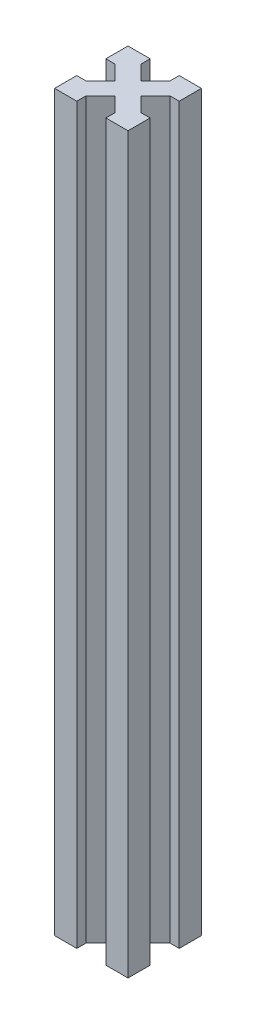
ISO-10303-21;
HEADER;
FILE_DESCRIPTION(('STEP AP214'),'2;1');
FILE_NAME('part.step','',(''),(''),'','','');
FILE_SCHEMA(('AUTOMOTIVE_DESIGN { 1 0 10303 214 1 1 1 1 }'));
ENDSEC;
DATA;
#1=APPLICATION_CONTEXT('core data for automotive mechanical design processes');
#2=APPLICATION_PROTOCOL_DEFINITION('international standard','automotive_design',2000,#1);
#3=PRODUCT_CONTEXT('',#1,'mechanical');
#4=PRODUCT('Part','Part','',(#3));
#5=PRODUCT_RELATED_PRODUCT_CATEGORY('part','',(#4));
#6=PRODUCT_DEFINITION_FORMATION('','',#4);
#7=PRODUCT_DEFINITION_CONTEXT('part definition',#1,'design');
#8=PRODUCT_DEFINITION('design','',#6,#7);
#9=PRODUCT_DEFINITION_SHAPE('','',#8);
#10=(LENGTH_UNIT() NAMED_UNIT(*) SI_UNIT(.MILLI.,.METRE.));
#11=(NAMED_UNIT(*) PLANE_ANGLE_UNIT() SI_UNIT($,.RADIAN.));
#12=(NAMED_UNIT(*) SI_UNIT($,.STERADIAN.) SOLID_ANGLE_UNIT());
#13=UNCERTAINTY_MEASURE_WITH_UNIT(LENGTH_MEASURE(1.E-05),#10,'distance_accuracy_value','');
#14=(GEOMETRIC_REPRESENTATION_CONTEXT(3) GLOBAL_UNCERTAINTY_ASSIGNED_CONTEXT((#13)) GLOBAL_UNIT_ASSIGNED_CONTEXT((#10,
#11,#12)) REPRESENTATION_CONTEXT('',''));
#15=CARTESIAN_POINT('',(0.,0.,0.));
#16=DIRECTION('',(0.,0.,1.));
#17=DIRECTION('',(1.,0.,0.));
#18=AXIS2_PLACEMENT_3D('',#15,#16,#17);
#19=CARTESIAN_POINT('',(-11.7677669529664,200.,-11.7677669529664));
#20=DIRECTION('',(0.707106781186548,0.,0.707106781186547));
#21=DIRECTION('',(0.707106781186547,0.,-0.707106781186548));
#22=AXIS2_PLACEMENT_3D('',#19,#20,#21);
#23=PLANE('',#22);
#24=DIRECTION('',(-0.707106781186547,0.,0.707106781186548));
#25=VECTOR('',#24,1.);
#26=CARTESIAN_POINT('',(-11.7677669529664,0.,-11.7677669529664));
#27=LINE('',#26,#25);
#28=CARTESIAN_POINT('',(-13.5355339059327,0.,-10.));
#29=VERTEX_POINT('',#28);
#30=CARTESIAN_POINT('',(-17.5,0.,-6.03553390593274));
#31=VERTEX_POINT('',#30);
#32=EDGE_CURVE('E226',#29,#31,#27,.T.);
#33=ORIENTED_EDGE('',*,*,#32,.T.);
#34=DIRECTION('',(0.,-1.,0.));
#35=VECTOR('',#34,1.);
#36=CARTESIAN_POINT('',(-17.5,200.,-6.03553390593274));
#37=LINE('',#36,#35);
#38=CARTESIAN_POINT('',(-17.5,200.,-6.03553390593274));
#39=VERTEX_POINT('',#38);
#40=EDGE_CURVE('E11',#39,#31,#37,.T.);
#41=ORIENTED_EDGE('',*,*,#40,.F.);
#42=DIRECTION('',(-0.707106781186547,0.,0.707106781186548));
#43=VECTOR('',#42,1.);
#44=CARTESIAN_POINT('',(-11.7677669529664,200.,-11.7677669529664));
#45=LINE('',#44,#43);
#46=CARTESIAN_POINT('',(-13.5355339059327,200.,-10.));
#47=VERTEX_POINT('',#46);
#48=EDGE_CURVE('E289',#47,#39,#45,.T.);
#49=ORIENTED_EDGE('',*,*,#48,.F.);
#50=DIRECTION('',(0.,-1.,0.));
#51=VECTOR('',#50,1.);
#52=CARTESIAN_POINT('',(-13.5355339059327,200.,-10.));
#53=LINE('',#52,#51);
#54=EDGE_CURVE('E222',#47,#29,#53,.T.);
#55=ORIENTED_EDGE('',*,*,#54,.T.);
#56=EDGE_LOOP('',(#33,#41,#49,#55));
#57=FACE_BOUND('',#56,.T.);
#58=ADVANCED_FACE('F36',(#57),#23,.F.);
#59=CARTESIAN_POINT('',(0.,200.,-6.03553390593273));
#60=DIRECTION('',(0.,0.,1.));
#61=DIRECTION('',(1.,0.,0.));
#62=AXIS2_PLACEMENT_3D('',#59,#60,#61);
#63=PLANE('',#62);
#64=DIRECTION('',(-1.,0.,0.));
#65=VECTOR('',#64,1.);
#66=CARTESIAN_POINT('',(0.,0.,-6.03553390593273));
#67=LINE('',#66,#65);
#68=CARTESIAN_POINT('',(-20.,0.,-6.03553390593273));
#69=VERTEX_POINT('',#68);
#70=EDGE_CURVE('E229',#31,#69,#67,.T.);
#71=ORIENTED_EDGE('',*,*,#70,.T.);
#72=DIRECTION('',(0.,-1.,0.));
#73=VECTOR('',#72,1.);
#74=CARTESIAN_POINT('',(-20.,200.,-6.03553390593273));
#75=LINE('',#74,#73);
#76=CARTESIAN_POINT('',(-20.,200.,-6.03553390593273));
#77=VERTEX_POINT('',#76);
#78=EDGE_CURVE('E44',#77,#69,#75,.T.);
#79=ORIENTED_EDGE('',*,*,#78,.F.);
#80=DIRECTION('',(-1.,0.,0.));
#81=VECTOR('',#80,1.);
#82=CARTESIAN_POINT('',(0.,200.,-6.03553390593273));
#83=LINE('',#82,#81);
#84=EDGE_CURVE('E139',#39,#77,#83,.T.);
#85=ORIENTED_EDGE('',*,*,#84,.F.);
#86=ORIENTED_EDGE('',*,*,#40,.T.);
#87=EDGE_LOOP('',(#71,#79,#85,#86));
#88=FACE_BOUND('',#87,.T.);
#89=ADVANCED_FACE('F338',(#88),#63,.F.);
#90=CARTESIAN_POINT('',(-20.,200.,0.));
#91=DIRECTION('',(-1.,0.,0.));
#92=DIRECTION('',(0.,0.,1.));
#93=AXIS2_PLACEMENT_3D('',#90,#91,#92);
#94=PLANE('',#93);
#95=DIRECTION('',(0.,0.,-1.));
#96=VECTOR('',#95,1.);
#97=CARTESIAN_POINT('',(-20.,0.,0.));
#98=LINE('',#97,#96);
#99=CARTESIAN_POINT('',(-20.,0.,0.));
#100=VERTEX_POINT('',#99);
#101=EDGE_CURVE('E232',#100,#69,#98,.T.);
#102=ORIENTED_EDGE('',*,*,#101,.F.);
#103=DIRECTION('',(0.,-1.,0.));
#104=VECTOR('',#103,1.);
#105=CARTESIAN_POINT('',(-20.,200.,0.));
#106=LINE('',#105,#104);
#107=CARTESIAN_POINT('',(-20.,200.,0.));
#108=VERTEX_POINT('',#107);
#109=EDGE_CURVE('E331',#108,#100,#106,.T.);
#110=ORIENTED_EDGE('',*,*,#109,.F.);
#111=DIRECTION('',(0.,0.,-1.));
#112=VECTOR('',#111,1.);
#113=CARTESIAN_POINT('',(-20.,200.,0.));
#114=LINE('',#113,#112);
#115=EDGE_CURVE('E337',#108,#77,#114,.T.);
#116=ORIENTED_EDGE('',*,*,#115,.T.);
#117=ORIENTED_EDGE('',*,*,#78,.T.);
#118=EDGE_LOOP('',(#102,#110,#116,#117));
#119=FACE_BOUND('',#118,.T.);
#120=ADVANCED_FACE('F335',(#119),#94,.T.);
#121=CARTESIAN_POINT('',(0.,200.,0.));
#122=DIRECTION('',(0.,0.,1.));
#123=DIRECTION('',(1.,0.,0.));
#124=AXIS2_PLACEMENT_3D('',#121,#122,#123);
#125=PLANE('',#124);
#126=DIRECTION('',(-1.,0.,0.));
#127=VECTOR('',#126,1.);
#128=CARTESIAN_POINT('',(0.,0.,0.));
#129=LINE('',#128,#127);
#130=CARTESIAN_POINT('',(-13.9644660940673,0.,0.));
#131=VERTEX_POINT('',#130);
#132=EDGE_CURVE('E235',#131,#100,#129,.T.);
#133=ORIENTED_EDGE('',*,*,#132,.F.);
#134=DIRECTION('',(0.,-1.,0.));
#135=VECTOR('',#134,1.);
#136=CARTESIAN_POINT('',(-13.9644660940673,200.,0.));
#137=LINE('',#136,#135);
#138=CARTESIAN_POINT('',(-13.9644660940673,200.,0.));
#139=VERTEX_POINT('',#138);
#140=EDGE_CURVE('E329',#139,#131,#137,.T.);
#141=ORIENTED_EDGE('',*,*,#140,.F.);
#142=DIRECTION('',(-1.,0.,0.));
#143=VECTOR('',#142,1.);
#144=CARTESIAN_POINT('',(0.,200.,0.));
#145=LINE('',#144,#143);
#146=EDGE_CURVE('E349',#139,#108,#145,.T.);
#147=ORIENTED_EDGE('',*,*,#146,.T.);
#148=ORIENTED_EDGE('',*,*,#109,.T.);
#149=EDGE_LOOP('',(#133,#141,#147,#148));
#150=FACE_BOUND('',#149,.T.);
#151=ADVANCED_FACE('F346',(#150),#125,.T.);
#152=CARTESIAN_POINT('',(-13.9644660940673,200.,0.));
#153=DIRECTION('',(1.,0.,0.));
#154=DIRECTION('',(0.,0.,-1.));
#155=AXIS2_PLACEMENT_3D('',#152,#153,#154);
#156=PLANE('',#155);
#157=DIRECTION('',(0.,0.,1.));
#158=VECTOR('',#157,1.);
#159=CARTESIAN_POINT('',(-13.9644660940673,0.,0.));
#160=LINE('',#159,#158);
#161=CARTESIAN_POINT('',(-13.9644660940673,0.,-2.5));
#162=VERTEX_POINT('',#161);
#163=EDGE_CURVE('E238',#162,#131,#160,.T.);
#164=ORIENTED_EDGE('',*,*,#163,.F.);
#165=DIRECTION('',(0.,-1.,0.));
#166=VECTOR('',#165,1.);
#167=CARTESIAN_POINT('',(-13.9644660940673,200.,-2.5));
#168=LINE('',#167,#166);
#169=CARTESIAN_POINT('',(-13.9644660940673,200.,-2.5));
#170=VERTEX_POINT('',#169);
#171=EDGE_CURVE('E327',#170,#162,#168,.T.);
#172=ORIENTED_EDGE('',*,*,#171,.F.);
#173=DIRECTION('',(0.,0.,1.));
#174=VECTOR('',#173,1.);
#175=CARTESIAN_POINT('',(-13.9644660940673,200.,0.));
#176=LINE('',#175,#174);
#177=EDGE_CURVE('E353',#170,#139,#176,.T.);
#178=ORIENTED_EDGE('',*,*,#177,.T.);
#179=ORIENTED_EDGE('',*,*,#140,.T.);
#180=EDGE_LOOP('',(#164,#172,#178,#179));
#181=FACE_BOUND('',#180,.T.);
#182=ADVANCED_FACE('F427',(#181),#156,.T.);
#183=CARTESIAN_POINT('',(-8.23223304703364,200.,-8.23223304703363));
#184=DIRECTION('',(0.707106781186548,0.,0.707106781186547));
#185=DIRECTION('',(0.707106781186547,0.,-0.707106781186548));
#186=AXIS2_PLACEMENT_3D('',#183,#184,#185);
#187=PLANE('',#186);
#188=DIRECTION('',(-0.707106781186547,0.,0.707106781186548));
#189=VECTOR('',#188,1.);
#190=CARTESIAN_POINT('',(-8.23223304703364,0.,-8.23223304703363));
#191=LINE('',#190,#189);
#192=CARTESIAN_POINT('',(-9.99999999999999,0.,-6.46446609406727));
#193=VERTEX_POINT('',#192);
#194=EDGE_CURVE('E241',#193,#162,#191,.T.);
#195=ORIENTED_EDGE('',*,*,#194,.F.);
#196=DIRECTION('',(0.,-1.,0.));
#197=VECTOR('',#196,1.);
#198=CARTESIAN_POINT('',(-9.99999999999999,200.,-6.46446609406727));
#199=LINE('',#198,#197);
#200=CARTESIAN_POINT('',(-9.99999999999999,200.,-6.46446609406727));
#201=VERTEX_POINT('',#200);
#202=EDGE_CURVE('E325',#201,#193,#199,.T.);
#203=ORIENTED_EDGE('',*,*,#202,.F.);
#204=DIRECTION('',(-0.707106781186547,0.,0.707106781186548));
#205=VECTOR('',#204,1.);
#206=CARTESIAN_POINT('',(-8.23223304703364,200.,-8.23223304703363));
#207=LINE('',#206,#205);
#208=EDGE_CURVE('E359',#201,#170,#207,.T.);
#209=ORIENTED_EDGE('',*,*,#208,.T.);
#210=ORIENTED_EDGE('',*,*,#171,.T.);
#211=EDGE_LOOP('',(#195,#203,#209,#210));
#212=FACE_BOUND('',#211,.T.);
#213=ADVANCED_FACE('F430',(#212),#187,.T.);
#214=CARTESIAN_POINT('',(-1.76776695296636,200.,1.76776695296636));
#215=DIRECTION('',(0.707106781186548,0.,-0.707106781186548));
#216=DIRECTION('',(-0.707106781186548,0.,-0.707106781186548));
#217=AXIS2_PLACEMENT_3D('',#214,#215,#216);
#218=PLANE('',#217);
#219=DIRECTION('',(0.707106781186548,0.,0.707106781186548));
#220=VECTOR('',#219,1.);
#221=CARTESIAN_POINT('',(-1.76776695296636,0.,1.76776695296636));
#222=LINE('',#221,#220);
#223=CARTESIAN_POINT('',(-6.03553390593273,0.,-2.5));
#224=VERTEX_POINT('',#223);
#225=EDGE_CURVE('E244',#193,#224,#222,.T.);
#226=ORIENTED_EDGE('',*,*,#225,.T.);
#227=DIRECTION('',(0.,-1.,0.));
#228=VECTOR('',#227,1.);
#229=CARTESIAN_POINT('',(-6.03553390593273,200.,-2.5));
#230=LINE('',#229,#228);
#231=CARTESIAN_POINT('',(-6.03553390593273,200.,-2.5));
#232=VERTEX_POINT('',#231);
#233=EDGE_CURVE('E322',#232,#224,#230,.T.);
#234=ORIENTED_EDGE('',*,*,#233,.F.);
#235=DIRECTION('',(0.707106781186548,0.,0.707106781186548));
#236=VECTOR('',#235,1.);
#237=CARTESIAN_POINT('',(-1.76776695296636,200.,1.76776695296636));
#238=LINE('',#237,#236);
#239=EDGE_CURVE('E362',#201,#232,#238,.T.);
#240=ORIENTED_EDGE('',*,*,#239,.F.);
#241=ORIENTED_EDGE('',*,*,#202,.T.);
#242=EDGE_LOOP('',(#226,#234,#240,#241));
#243=FACE_BOUND('',#242,.T.);
#244=ADVANCED_FACE('F434',(#243),#218,.F.);
#245=CARTESIAN_POINT('',(-6.03553390593273,200.,0.));
#246=DIRECTION('',(1.,0.,0.));
#247=DIRECTION('',(0.,0.,-1.));
#248=AXIS2_PLACEMENT_3D('',#245,#246,#247);
#249=PLANE('',#248);
#250=DIRECTION('',(0.,0.,1.));
#251=VECTOR('',#250,1.);
#252=CARTESIAN_POINT('',(-6.03553390593273,0.,0.));
#253=LINE('',#252,#251);
#254=CARTESIAN_POINT('',(-6.03553390593273,0.,0.));
#255=VERTEX_POINT('',#254);
#256=EDGE_CURVE('E246',#224,#255,#253,.T.);
#257=ORIENTED_EDGE('',*,*,#256,.T.);
#258=DIRECTION('',(0.,-1.,0.));
#259=VECTOR('',#258,1.);
#260=CARTESIAN_POINT('',(-6.03553390593273,200.,0.));
#261=LINE('',#260,#259);
#262=CARTESIAN_POINT('',(-6.03553390593273,200.,0.));
#263=VERTEX_POINT('',#262);
#264=EDGE_CURVE('E320',#263,#255,#261,.T.);
#265=ORIENTED_EDGE('',*,*,#264,.F.);
#266=DIRECTION('',(0.,0.,1.));
#267=VECTOR('',#266,1.);
#268=CARTESIAN_POINT('',(-6.03553390593273,200.,0.));
#269=LINE('',#268,#267);
#270=EDGE_CURVE('E364',#232,#263,#269,.T.);
#271=ORIENTED_EDGE('',*,*,#270,.F.);
#272=ORIENTED_EDGE('',*,*,#233,.T.);
#273=EDGE_LOOP('',(#257,#265,#271,#272));
#274=FACE_BOUND('',#273,.T.);
#275=ADVANCED_FACE('F438',(#274),#249,.F.);
#276=CARTESIAN_POINT('',(0.,200.,0.));
#277=DIRECTION('',(0.,0.,1.));
#278=DIRECTION('',(1.,0.,0.));
#279=AXIS2_PLACEMENT_3D('',#276,#277,#278);
#280=PLANE('',#279);
#281=DIRECTION('',(-1.,0.,0.));
#282=VECTOR('',#281,1.);
#283=CARTESIAN_POINT('',(0.,0.,0.));
#284=LINE('',#283,#282);
#285=CARTESIAN_POINT('',(0.,0.,0.));
#286=VERTEX_POINT('',#285);
#287=EDGE_CURVE('E249',#286,#255,#284,.T.);
#288=ORIENTED_EDGE('',*,*,#287,.F.);
#289=DIRECTION('',(0.,-1.,0.));
#290=VECTOR('',#289,1.);
#291=CARTESIAN_POINT('',(0.,200.,0.));
#292=LINE('',#291,#290);
#293=CARTESIAN_POINT('',(0.,200.,0.));
#294=VERTEX_POINT('',#293);
#295=EDGE_CURVE('E318',#294,#286,#292,.T.);
#296=ORIENTED_EDGE('',*,*,#295,.F.);
#297=DIRECTION('',(-1.,0.,0.));
#298=VECTOR('',#297,1.);
#299=CARTESIAN_POINT('',(0.,200.,0.));
#300=LINE('',#299,#298);
#301=EDGE_CURVE('E366',#294,#263,#300,.T.);
#302=ORIENTED_EDGE('',*,*,#301,.T.);
#303=ORIENTED_EDGE('',*,*,#264,.T.);
#304=EDGE_LOOP('',(#288,#296,#302,#303));
#305=FACE_BOUND('',#304,.T.);
#306=ADVANCED_FACE('F442',(#305),#280,.T.);
#307=CARTESIAN_POINT('',(0.,200.,0.));
#308=DIRECTION('',(-1.,0.,0.));
#309=DIRECTION('',(0.,0.,1.));
#310=AXIS2_PLACEMENT_3D('',#307,#308,#309);
#311=PLANE('',#310);
#312=DIRECTION('',(0.,0.,-1.));
#313=VECTOR('',#312,1.);
#314=CARTESIAN_POINT('',(0.,0.,0.));
#315=LINE('',#314,#313);
#316=CARTESIAN_POINT('',(0.,0.,-6.03553390593273));
#317=VERTEX_POINT('',#316);
#318=EDGE_CURVE('E252',#286,#317,#315,.T.);
#319=ORIENTED_EDGE('',*,*,#318,.T.);
#320=DIRECTION('',(0.,-1.,0.));
#321=VECTOR('',#320,1.);
#322=CARTESIAN_POINT('',(0.,200.,-6.03553390593273));
#323=LINE('',#322,#321);
#324=CARTESIAN_POINT('',(0.,200.,-6.03553390593273));
#325=VERTEX_POINT('',#324);
#326=EDGE_CURVE('E316',#325,#317,#323,.T.);
#327=ORIENTED_EDGE('',*,*,#326,.F.);
#328=DIRECTION('',(0.,0.,-1.));
#329=VECTOR('',#328,1.);
#330=CARTESIAN_POINT('',(0.,200.,0.));
#331=LINE('',#330,#329);
#332=EDGE_CURVE('E369',#294,#325,#331,.T.);
#333=ORIENTED_EDGE('',*,*,#332,.F.);
#334=ORIENTED_EDGE('',*,*,#295,.T.);
#335=EDGE_LOOP('',(#319,#327,#333,#334));
#336=FACE_BOUND('',#335,.T.);
#337=ADVANCED_FACE('F446',(#336),#311,.F.);
#338=CARTESIAN_POINT('',(0.,200.,-6.03553390593273));
#339=DIRECTION('',(0.,0.,-1.));
#340=DIRECTION('',(-1.,0.,0.));
#341=AXIS2_PLACEMENT_3D('',#338,#339,#340);
#342=PLANE('',#341);
#343=DIRECTION('',(1.,0.,0.));
#344=VECTOR('',#343,1.);
#345=CARTESIAN_POINT('',(0.,0.,-6.03553390593273));
#346=LINE('',#345,#344);
#347=CARTESIAN_POINT('',(-2.5,0.,-6.03553390593274));
#348=VERTEX_POINT('',#347);
#349=EDGE_CURVE('E255',#348,#317,#346,.T.);
#350=ORIENTED_EDGE('',*,*,#349,.F.);
#351=DIRECTION('',(0.,-1.,0.));
#352=VECTOR('',#351,1.);
#353=CARTESIAN_POINT('',(-2.5,200.,-6.03553390593274));
#354=LINE('',#353,#352);
#355=CARTESIAN_POINT('',(-2.5,200.,-6.03553390593274));
#356=VERTEX_POINT('',#355);
#357=EDGE_CURVE('E314',#356,#348,#354,.T.);
#358=ORIENTED_EDGE('',*,*,#357,.F.);
#359=DIRECTION('',(1.,0.,0.));
#360=VECTOR('',#359,1.);
#361=CARTESIAN_POINT('',(0.,200.,-6.03553390593273));
#362=LINE('',#361,#360);
#363=EDGE_CURVE('E371',#356,#325,#362,.T.);
#364=ORIENTED_EDGE('',*,*,#363,.T.);
#365=ORIENTED_EDGE('',*,*,#326,.T.);
#366=EDGE_LOOP('',(#350,#358,#364,#365));
#367=FACE_BOUND('',#366,.T.);
#368=ADVANCED_FACE('F450',(#367),#342,.T.);
#369=CARTESIAN_POINT('',(1.76776695296637,200.,-1.76776695296637));
#370=DIRECTION('',(0.707106781186548,0.,-0.707106781186548));
#371=DIRECTION('',(-0.707106781186548,0.,-0.707106781186548));
#372=AXIS2_PLACEMENT_3D('',#369,#370,#371);
#373=PLANE('',#372);
#374=DIRECTION('',(0.707106781186548,0.,0.707106781186548));
#375=VECTOR('',#374,1.);
#376=CARTESIAN_POINT('',(1.76776695296637,0.,-1.76776695296637));
#377=LINE('',#376,#375);
#378=CARTESIAN_POINT('',(-6.46446609406727,0.,-10.));
#379=VERTEX_POINT('',#378);
#380=EDGE_CURVE('E258',#379,#348,#377,.T.);
#381=ORIENTED_EDGE('',*,*,#380,.F.);
#382=DIRECTION('',(0.,-1.,0.));
#383=VECTOR('',#382,1.);
#384=CARTESIAN_POINT('',(-6.46446609406727,200.,-10.));
#385=LINE('',#384,#383);
#386=CARTESIAN_POINT('',(-6.46446609406727,200.,-10.));
#387=VERTEX_POINT('',#386);
#388=EDGE_CURVE('E312',#387,#379,#385,.T.);
#389=ORIENTED_EDGE('',*,*,#388,.F.);
#390=DIRECTION('',(0.707106781186548,0.,0.707106781186548));
#391=VECTOR('',#390,1.);
#392=CARTESIAN_POINT('',(1.76776695296637,200.,-1.76776695296637));
#393=LINE('',#392,#391);
#394=EDGE_CURVE('E374',#387,#356,#393,.T.);
#395=ORIENTED_EDGE('',*,*,#394,.T.);
#396=ORIENTED_EDGE('',*,*,#357,.T.);
#397=EDGE_LOOP('',(#381,#389,#395,#396));
#398=FACE_BOUND('',#397,.T.);
#399=ADVANCED_FACE('F454',(#398),#373,.T.);
#400=CARTESIAN_POINT('',(-8.23223304703364,200.,-8.23223304703363));
#401=DIRECTION('',(0.707106781186548,0.,0.707106781186547));
#402=DIRECTION('',(0.707106781186547,0.,-0.707106781186548));
#403=AXIS2_PLACEMENT_3D('',#400,#401,#402);
#404=PLANE('',#403);
#405=DIRECTION('',(-0.707106781186547,0.,0.707106781186548));
#406=VECTOR('',#405,1.);
#407=CARTESIAN_POINT('',(-8.23223304703364,0.,-8.23223304703363));
#408=LINE('',#407,#406);
#409=CARTESIAN_POINT('',(-2.50000000000001,0.,-13.9644660940673));
#410=VERTEX_POINT('',#409);
#411=EDGE_CURVE('E261',#410,#379,#408,.T.);
#412=ORIENTED_EDGE('',*,*,#411,.F.);
#413=DIRECTION('',(0.,-1.,0.));
#414=VECTOR('',#413,1.);
#415=CARTESIAN_POINT('',(-2.50000000000001,200.,-13.9644660940673));
#416=LINE('',#415,#414);
#417=CARTESIAN_POINT('',(-2.50000000000001,200.,-13.9644660940673));
#418=VERTEX_POINT('',#417);
#419=EDGE_CURVE('E310',#418,#410,#416,.T.);
#420=ORIENTED_EDGE('',*,*,#419,.F.);
#421=DIRECTION('',(-0.707106781186547,0.,0.707106781186548));
#422=VECTOR('',#421,1.);
#423=CARTESIAN_POINT('',(-8.23223304703364,200.,-8.23223304703363));
#424=LINE('',#423,#422);
#425=EDGE_CURVE('E377',#418,#387,#424,.T.);
#426=ORIENTED_EDGE('',*,*,#425,.T.);
#427=ORIENTED_EDGE('',*,*,#388,.T.);
#428=EDGE_LOOP('',(#412,#420,#426,#427));
#429=FACE_BOUND('',#428,.T.);
#430=ADVANCED_FACE('F458',(#429),#404,.T.);
#431=CARTESIAN_POINT('',(0.,200.,-13.9644660940673));
#432=DIRECTION('',(0.,0.,-1.));
#433=DIRECTION('',(-1.,0.,0.));
#434=AXIS2_PLACEMENT_3D('',#431,#432,#433);
#435=PLANE('',#434);
#436=DIRECTION('',(1.,0.,0.));
#437=VECTOR('',#436,1.);
#438=CARTESIAN_POINT('',(0.,0.,-13.9644660940673));
#439=LINE('',#438,#437);
#440=CARTESIAN_POINT('',(0.,0.,-13.9644660940673));
#441=VERTEX_POINT('',#440);
#442=EDGE_CURVE('E264',#410,#441,#439,.T.);
#443=ORIENTED_EDGE('',*,*,#442,.T.);
#444=DIRECTION('',(0.,-1.,0.));
#445=VECTOR('',#444,1.);
#446=CARTESIAN_POINT('',(0.,200.,-13.9644660940673));
#447=LINE('',#446,#445);
#448=CARTESIAN_POINT('',(0.,200.,-13.9644660940673));
#449=VERTEX_POINT('',#448);
#450=EDGE_CURVE('E307',#449,#441,#447,.T.);
#451=ORIENTED_EDGE('',*,*,#450,.F.);
#452=DIRECTION('',(1.,0.,0.));
#453=VECTOR('',#452,1.);
#454=CARTESIAN_POINT('',(0.,200.,-13.9644660940673));
#455=LINE('',#454,#453);
#456=EDGE_CURVE('E380',#418,#449,#455,.T.);
#457=ORIENTED_EDGE('',*,*,#456,.F.);
#458=ORIENTED_EDGE('',*,*,#419,.T.);
#459=EDGE_LOOP('',(#443,#451,#457,#458));
#460=FACE_BOUND('',#459,.T.);
#461=ADVANCED_FACE('F462',(#460),#435,.F.);
#462=CARTESIAN_POINT('',(0.,200.,0.));
#463=DIRECTION('',(-1.,0.,0.));
#464=DIRECTION('',(0.,0.,1.));
#465=AXIS2_PLACEMENT_3D('',#462,#463,#464);
#466=PLANE('',#465);
#467=DIRECTION('',(0.,0.,-1.));
#468=VECTOR('',#467,1.);
#469=CARTESIAN_POINT('',(0.,0.,0.));
#470=LINE('',#469,#468);
#471=CARTESIAN_POINT('',(0.,0.,-20.));
#472=VERTEX_POINT('',#471);
#473=EDGE_CURVE('E266',#441,#472,#470,.T.);
#474=ORIENTED_EDGE('',*,*,#473,.T.);
#475=DIRECTION('',(0.,-1.,0.));
#476=VECTOR('',#475,1.);
#477=CARTESIAN_POINT('',(0.,200.,-20.));
#478=LINE('',#477,#476);
#479=CARTESIAN_POINT('',(0.,200.,-20.));
#480=VERTEX_POINT('',#479);
#481=EDGE_CURVE('E304',#480,#472,#478,.T.);
#482=ORIENTED_EDGE('',*,*,#481,.F.);
#483=DIRECTION('',(0.,0.,-1.));
#484=VECTOR('',#483,1.);
#485=CARTESIAN_POINT('',(0.,200.,0.));
#486=LINE('',#485,#484);
#487=EDGE_CURVE('E382',#449,#480,#486,.T.);
#488=ORIENTED_EDGE('',*,*,#487,.F.);
#489=ORIENTED_EDGE('',*,*,#450,.T.);
#490=EDGE_LOOP('',(#474,#482,#488,#489));
#491=FACE_BOUND('',#490,.T.);
#492=ADVANCED_FACE('F466',(#491),#466,.F.);
#493=CARTESIAN_POINT('',(0.,200.,-20.));
#494=DIRECTION('',(0.,0.,1.));
#495=DIRECTION('',(1.,0.,0.));
#496=AXIS2_PLACEMENT_3D('',#493,#494,#495);
#497=PLANE('',#496);
#498=DIRECTION('',(-1.,0.,0.));
#499=VECTOR('',#498,1.);
#500=CARTESIAN_POINT('',(0.,0.,-20.));
#501=LINE('',#500,#499);
#502=CARTESIAN_POINT('',(-6.03553390593273,0.,-20.));
#503=VERTEX_POINT('',#502);
#504=EDGE_CURVE('E268',#472,#503,#501,.T.);
#505=ORIENTED_EDGE('',*,*,#504,.T.);
#506=DIRECTION('',(0.,-1.,0.));
#507=VECTOR('',#506,1.);
#508=CARTESIAN_POINT('',(-6.03553390593273,200.,-20.));
#509=LINE('',#508,#507);
#510=CARTESIAN_POINT('',(-6.03553390593273,200.,-20.));
#511=VERTEX_POINT('',#510);
#512=EDGE_CURVE('E302',#511,#503,#509,.T.);
#513=ORIENTED_EDGE('',*,*,#512,.F.);
#514=DIRECTION('',(-1.,0.,0.));
#515=VECTOR('',#514,1.);
#516=CARTESIAN_POINT('',(0.,200.,-20.));
#517=LINE('',#516,#515);
#518=EDGE_CURVE('E384',#480,#511,#517,.T.);
#519=ORIENTED_EDGE('',*,*,#518,.F.);
#520=ORIENTED_EDGE('',*,*,#481,.T.);
#521=EDGE_LOOP('',(#505,#513,#519,#520));
#522=FACE_BOUND('',#521,.T.);
#523=ADVANCED_FACE('F470',(#522),#497,.F.);
#524=CARTESIAN_POINT('',(-6.03553390593271,200.,0.));
#525=DIRECTION('',(-1.,0.,0.));
#526=DIRECTION('',(0.,0.,1.));
#527=AXIS2_PLACEMENT_3D('',#524,#525,#526);
#528=PLANE('',#527);
#529=DIRECTION('',(0.,0.,-1.));
#530=VECTOR('',#529,1.);
#531=CARTESIAN_POINT('',(-6.03553390593271,0.,0.));
#532=LINE('',#531,#530);
#533=CARTESIAN_POINT('',(-6.03553390593274,0.,-17.5));
#534=VERTEX_POINT('',#533);
#535=EDGE_CURVE('E271',#534,#503,#532,.T.);
#536=ORIENTED_EDGE('',*,*,#535,.F.);
#537=DIRECTION('',(0.,-1.,0.));
#538=VECTOR('',#537,1.);
#539=CARTESIAN_POINT('',(-6.03553390593274,200.,-17.5));
#540=LINE('',#539,#538);
#541=CARTESIAN_POINT('',(-6.03553390593274,200.,-17.5));
#542=VERTEX_POINT('',#541);
#543=EDGE_CURVE('E300',#542,#534,#540,.T.);
#544=ORIENTED_EDGE('',*,*,#543,.F.);
#545=DIRECTION('',(0.,0.,-1.));
#546=VECTOR('',#545,1.);
#547=CARTESIAN_POINT('',(-6.03553390593271,200.,0.));
#548=LINE('',#547,#546);
#549=EDGE_CURVE('E386',#542,#511,#548,.T.);
#550=ORIENTED_EDGE('',*,*,#549,.T.);
#551=ORIENTED_EDGE('',*,*,#512,.T.);
#552=EDGE_LOOP('',(#536,#544,#550,#551));
#553=FACE_BOUND('',#552,.T.);
#554=ADVANCED_FACE('F474',(#553),#528,.T.);
#555=CARTESIAN_POINT('',(-11.7677669529664,200.,-11.7677669529664));
#556=DIRECTION('',(0.707106781186548,0.,0.707106781186547));
#557=DIRECTION('',(0.707106781186547,0.,-0.707106781186548));
#558=AXIS2_PLACEMENT_3D('',#555,#556,#557);
#559=PLANE('',#558);
#560=DIRECTION('',(-0.707106781186547,0.,0.707106781186548));
#561=VECTOR('',#560,1.);
#562=CARTESIAN_POINT('',(-11.7677669529664,0.,-11.7677669529664));
#563=LINE('',#562,#561);
#564=CARTESIAN_POINT('',(-10.,0.,-13.5355339059327));
#565=VERTEX_POINT('',#564);
#566=EDGE_CURVE('E274',#534,#565,#563,.T.);
#567=ORIENTED_EDGE('',*,*,#566,.T.);
#568=DIRECTION('',(0.,-1.,0.));
#569=VECTOR('',#568,1.);
#570=CARTESIAN_POINT('',(-10.,200.,-13.5355339059327));
#571=LINE('',#570,#569);
#572=CARTESIAN_POINT('',(-10.,200.,-13.5355339059327));
#573=VERTEX_POINT('',#572);
#574=EDGE_CURVE('E298',#573,#565,#571,.T.);
#575=ORIENTED_EDGE('',*,*,#574,.F.);
#576=DIRECTION('',(-0.707106781186547,0.,0.707106781186548));
#577=VECTOR('',#576,1.);
#578=CARTESIAN_POINT('',(-11.7677669529664,200.,-11.7677669529664));
#579=LINE('',#578,#577);
#580=EDGE_CURVE('E389',#542,#573,#579,.T.);
#581=ORIENTED_EDGE('',*,*,#580,.F.);
#582=ORIENTED_EDGE('',*,*,#543,.T.);
#583=EDGE_LOOP('',(#567,#575,#581,#582));
#584=FACE_BOUND('',#583,.T.);
#585=ADVANCED_FACE('F478',(#584),#559,.F.);
#586=CARTESIAN_POINT('',(1.76776695296637,200.,-1.76776695296637));
#587=DIRECTION('',(0.707106781186548,0.,-0.707106781186548));
#588=DIRECTION('',(-0.707106781186548,0.,-0.707106781186548));
#589=AXIS2_PLACEMENT_3D('',#586,#587,#588);
#590=PLANE('',#589);
#591=DIRECTION('',(0.707106781186548,0.,0.707106781186548));
#592=VECTOR('',#591,1.);
#593=CARTESIAN_POINT('',(1.76776695296637,0.,-1.76776695296637));
#594=LINE('',#593,#592);
#595=CARTESIAN_POINT('',(-13.9644660940673,0.,-17.5));
#596=VERTEX_POINT('',#595);
#597=EDGE_CURVE('E277',#596,#565,#594,.T.);
#598=ORIENTED_EDGE('',*,*,#597,.F.);
#599=DIRECTION('',(0.,-1.,0.));
#600=VECTOR('',#599,1.);
#601=CARTESIAN_POINT('',(-13.9644660940673,200.,-17.5));
#602=LINE('',#601,#600);
#603=CARTESIAN_POINT('',(-13.9644660940673,200.,-17.5));
#604=VERTEX_POINT('',#603);
#605=EDGE_CURVE('E296',#604,#596,#602,.T.);
#606=ORIENTED_EDGE('',*,*,#605,.F.);
#607=DIRECTION('',(0.707106781186548,0.,0.707106781186548));
#608=VECTOR('',#607,1.);
#609=CARTESIAN_POINT('',(1.76776695296637,200.,-1.76776695296637));
#610=LINE('',#609,#608);
#611=EDGE_CURVE('E391',#604,#573,#610,.T.);
#612=ORIENTED_EDGE('',*,*,#611,.T.);
#613=ORIENTED_EDGE('',*,*,#574,.T.);
#614=EDGE_LOOP('',(#598,#606,#612,#613));
#615=FACE_BOUND('',#614,.T.);
#616=ADVANCED_FACE('F482',(#615),#590,.T.);
#617=CARTESIAN_POINT('',(-13.9644660940673,200.,0.));
#618=DIRECTION('',(-1.,0.,0.));
#619=DIRECTION('',(0.,0.,1.));
#620=AXIS2_PLACEMENT_3D('',#617,#618,#619);
#621=PLANE('',#620);
#622=DIRECTION('',(0.,0.,-1.));
#623=VECTOR('',#622,1.);
#624=CARTESIAN_POINT('',(-13.9644660940673,0.,0.));
#625=LINE('',#624,#623);
#626=CARTESIAN_POINT('',(-13.9644660940673,0.,-20.));
#627=VERTEX_POINT('',#626);
#628=EDGE_CURVE('E280',#596,#627,#625,.T.);
#629=ORIENTED_EDGE('',*,*,#628,.T.);
#630=DIRECTION('',(0.,-1.,0.));
#631=VECTOR('',#630,1.);
#632=CARTESIAN_POINT('',(-13.9644660940673,200.,-20.));
#633=LINE('',#632,#631);
#634=CARTESIAN_POINT('',(-13.9644660940673,200.,-20.));
#635=VERTEX_POINT('',#634);
#636=EDGE_CURVE('E293',#635,#627,#633,.T.);
#637=ORIENTED_EDGE('',*,*,#636,.F.);
#638=DIRECTION('',(0.,0.,-1.));
#639=VECTOR('',#638,1.);
#640=CARTESIAN_POINT('',(-13.9644660940673,200.,0.));
#641=LINE('',#640,#639);
#642=EDGE_CURVE('E394',#604,#635,#641,.T.);
#643=ORIENTED_EDGE('',*,*,#642,.F.);
#644=ORIENTED_EDGE('',*,*,#605,.T.);
#645=EDGE_LOOP('',(#629,#637,#643,#644));
#646=FACE_BOUND('',#645,.T.);
#647=ADVANCED_FACE('F399',(#646),#621,.F.);
#648=CARTESIAN_POINT('',(0.,200.,-20.));
#649=DIRECTION('',(0.,0.,1.));
#650=DIRECTION('',(1.,0.,0.));
#651=AXIS2_PLACEMENT_3D('',#648,#649,#650);
#652=PLANE('',#651);
#653=DIRECTION('',(-1.,0.,0.));
#654=VECTOR('',#653,1.);
#655=CARTESIAN_POINT('',(0.,0.,-20.));
#656=LINE('',#655,#654);
#657=CARTESIAN_POINT('',(-20.,0.,-20.));
#658=VERTEX_POINT('',#657);
#659=EDGE_CURVE('E282',#627,#658,#656,.T.);
#660=ORIENTED_EDGE('',*,*,#659,.T.);
#661=DIRECTION('',(0.,-1.,0.));
#662=VECTOR('',#661,1.);
#663=CARTESIAN_POINT('',(-20.,200.,-20.));
#664=LINE('',#663,#662);
#665=CARTESIAN_POINT('',(-20.,200.,-20.));
#666=VERTEX_POINT('',#665);
#667=EDGE_CURVE('E212',#666,#658,#664,.T.);
#668=ORIENTED_EDGE('',*,*,#667,.F.);
#669=DIRECTION('',(-1.,0.,0.));
#670=VECTOR('',#669,1.);
#671=CARTESIAN_POINT('',(0.,200.,-20.));
#672=LINE('',#671,#670);
#673=EDGE_CURVE('E217',#635,#666,#672,.T.);
#674=ORIENTED_EDGE('',*,*,#673,.F.);
#675=ORIENTED_EDGE('',*,*,#636,.T.);
#676=EDGE_LOOP('',(#660,#668,#674,#675));
#677=FACE_BOUND('',#676,.T.);
#678=ADVANCED_FACE('F403',(#677),#652,.F.);
#679=CARTESIAN_POINT('',(-20.,200.,0.));
#680=DIRECTION('',(-1.,0.,0.));
#681=DIRECTION('',(0.,0.,1.));
#682=AXIS2_PLACEMENT_3D('',#679,#680,#681);
#683=PLANE('',#682);
#684=DIRECTION('',(0.,0.,-1.));
#685=VECTOR('',#684,1.);
#686=CARTESIAN_POINT('',(-20.,0.,0.));
#687=LINE('',#686,#685);
#688=CARTESIAN_POINT('',(-20.,0.,-13.9644660940673));
#689=VERTEX_POINT('',#688);
#690=EDGE_CURVE('E207',#689,#658,#687,.T.);
#691=ORIENTED_EDGE('',*,*,#690,.F.);
#692=DIRECTION('',(0.,-1.,0.));
#693=VECTOR('',#692,1.);
#694=CARTESIAN_POINT('',(-20.,200.,-13.9644660940673));
#695=LINE('',#694,#693);
#696=CARTESIAN_POINT('',(-20.,200.,-13.9644660940673));
#697=VERTEX_POINT('',#696);
#698=EDGE_CURVE('E202',#697,#689,#695,.T.);
#699=ORIENTED_EDGE('',*,*,#698,.F.);
#700=DIRECTION('',(0.,0.,-1.));
#701=VECTOR('',#700,1.);
#702=CARTESIAN_POINT('',(-20.,200.,0.));
#703=LINE('',#702,#701);
#704=EDGE_CURVE('E205',#697,#666,#703,.T.);
#705=ORIENTED_EDGE('',*,*,#704,.T.);
#706=ORIENTED_EDGE('',*,*,#667,.T.);
#707=EDGE_LOOP('',(#691,#699,#705,#706));
#708=FACE_BOUND('',#707,.T.);
#709=ADVANCED_FACE('F204',(#708),#683,.T.);
#710=CARTESIAN_POINT('',(0.,200.,-13.9644660940673));
#711=DIRECTION('',(0.,0.,1.));
#712=DIRECTION('',(1.,0.,0.));
#713=AXIS2_PLACEMENT_3D('',#710,#711,#712);
#714=PLANE('',#713);
#715=DIRECTION('',(-1.,0.,0.));
#716=VECTOR('',#715,1.);
#717=CARTESIAN_POINT('',(0.,0.,-13.9644660940673));
#718=LINE('',#717,#716);
#719=CARTESIAN_POINT('',(-17.5,0.,-13.9644660940673));
#720=VERTEX_POINT('',#719);
#721=EDGE_CURVE('E286',#720,#689,#718,.T.);
#722=ORIENTED_EDGE('',*,*,#721,.F.);
#723=DIRECTION('',(0.,-1.,0.));
#724=VECTOR('',#723,1.);
#725=CARTESIAN_POINT('',(-17.5,200.,-13.9644660940673));
#726=LINE('',#725,#724);
#727=CARTESIAN_POINT('',(-17.5,200.,-13.9644660940673));
#728=VERTEX_POINT('',#727);
#729=EDGE_CURVE('E128',#728,#720,#726,.T.);
#730=ORIENTED_EDGE('',*,*,#729,.F.);
#731=DIRECTION('',(-1.,0.,0.));
#732=VECTOR('',#731,1.);
#733=CARTESIAN_POINT('',(0.,200.,-13.9644660940673));
#734=LINE('',#733,#732);
#735=EDGE_CURVE('E215',#728,#697,#734,.T.);
#736=ORIENTED_EDGE('',*,*,#735,.T.);
#737=ORIENTED_EDGE('',*,*,#698,.T.);
#738=EDGE_LOOP('',(#722,#730,#736,#737));
#739=FACE_BOUND('',#738,.T.);
#740=ADVANCED_FACE('F220',(#739),#714,.T.);
#741=CARTESIAN_POINT('',(-1.76776695296636,200.,1.76776695296636));
#742=DIRECTION('',(0.707106781186548,0.,-0.707106781186548));
#743=DIRECTION('',(-0.707106781186548,0.,-0.707106781186548));
#744=AXIS2_PLACEMENT_3D('',#741,#742,#743);
#745=PLANE('',#744);
#746=DIRECTION('',(0.707106781186548,0.,0.707106781186548));
#747=VECTOR('',#746,1.);
#748=CARTESIAN_POINT('',(-1.76776695296636,0.,1.76776695296636));
#749=LINE('',#748,#747);
#750=EDGE_CURVE('E131',#720,#29,#749,.T.);
#751=ORIENTED_EDGE('',*,*,#750,.T.);
#752=ORIENTED_EDGE('',*,*,#54,.F.);
#753=DIRECTION('',(0.707106781186548,0.,0.707106781186548));
#754=VECTOR('',#753,1.);
#755=CARTESIAN_POINT('',(-1.76776695296636,200.,1.76776695296636));
#756=LINE('',#755,#754);
#757=EDGE_CURVE('E52',#728,#47,#756,.T.);
#758=ORIENTED_EDGE('',*,*,#757,.F.);
#759=ORIENTED_EDGE('',*,*,#729,.T.);
#760=EDGE_LOOP('',(#751,#752,#758,#759));
#761=FACE_BOUND('',#760,.T.);
#762=ADVANCED_FACE('F406',(#761),#745,.F.);
#763=CARTESIAN_POINT('',(0.,200.,0.));
#764=DIRECTION('',(0.,1.,0.));
#765=DIRECTION('',(0.,0.,1.));
#766=AXIS2_PLACEMENT_3D('',#763,#764,#765);
#767=PLANE('',#766);
#768=ORIENTED_EDGE('',*,*,#48,.T.);
#769=ORIENTED_EDGE('',*,*,#84,.T.);
#770=ORIENTED_EDGE('',*,*,#115,.F.);
#771=ORIENTED_EDGE('',*,*,#146,.F.);
#772=ORIENTED_EDGE('',*,*,#177,.F.);
#773=ORIENTED_EDGE('',*,*,#208,.F.);
#774=ORIENTED_EDGE('',*,*,#239,.T.);
#775=ORIENTED_EDGE('',*,*,#270,.T.);
#776=ORIENTED_EDGE('',*,*,#301,.F.);
#777=ORIENTED_EDGE('',*,*,#332,.T.);
#778=ORIENTED_EDGE('',*,*,#363,.F.);
#779=ORIENTED_EDGE('',*,*,#394,.F.);
#780=ORIENTED_EDGE('',*,*,#425,.F.);
#781=ORIENTED_EDGE('',*,*,#456,.T.);
#782=ORIENTED_EDGE('',*,*,#487,.T.);
#783=ORIENTED_EDGE('',*,*,#518,.T.);
#784=ORIENTED_EDGE('',*,*,#549,.F.);
#785=ORIENTED_EDGE('',*,*,#580,.T.);
#786=ORIENTED_EDGE('',*,*,#611,.F.);
#787=ORIENTED_EDGE('',*,*,#642,.T.);
#788=ORIENTED_EDGE('',*,*,#673,.T.);
#789=ORIENTED_EDGE('',*,*,#704,.F.);
#790=ORIENTED_EDGE('',*,*,#735,.F.);
#791=ORIENTED_EDGE('',*,*,#757,.T.);
#792=EDGE_LOOP('',(#768,#769,#770,#771,#772,#773,#774,#775,#776,#777,#778,#779,#780,#781,#782,
#783,#784,#785,#786,#787,#788,#789,#790,#791));
#793=FACE_BOUND('',#792,.T.);
#794=ADVANCED_FACE('F214',(#793),#767,.T.);
#795=CARTESIAN_POINT('',(0.,0.,0.));
#796=DIRECTION('',(0.,1.,0.));
#797=DIRECTION('',(0.,0.,1.));
#798=AXIS2_PLACEMENT_3D('',#795,#796,#797);
#799=PLANE('',#798);
#800=ORIENTED_EDGE('',*,*,#32,.F.);
#801=ORIENTED_EDGE('',*,*,#750,.F.);
#802=ORIENTED_EDGE('',*,*,#721,.T.);
#803=ORIENTED_EDGE('',*,*,#690,.T.);
#804=ORIENTED_EDGE('',*,*,#659,.F.);
#805=ORIENTED_EDGE('',*,*,#628,.F.);
#806=ORIENTED_EDGE('',*,*,#597,.T.);
#807=ORIENTED_EDGE('',*,*,#566,.F.);
#808=ORIENTED_EDGE('',*,*,#535,.T.);
#809=ORIENTED_EDGE('',*,*,#504,.F.);
#810=ORIENTED_EDGE('',*,*,#473,.F.);
#811=ORIENTED_EDGE('',*,*,#442,.F.);
#812=ORIENTED_EDGE('',*,*,#411,.T.);
#813=ORIENTED_EDGE('',*,*,#380,.T.);
#814=ORIENTED_EDGE('',*,*,#349,.T.);
#815=ORIENTED_EDGE('',*,*,#318,.F.);
#816=ORIENTED_EDGE('',*,*,#287,.T.);
#817=ORIENTED_EDGE('',*,*,#256,.F.);
#818=ORIENTED_EDGE('',*,*,#225,.F.);
#819=ORIENTED_EDGE('',*,*,#194,.T.);
#820=ORIENTED_EDGE('',*,*,#163,.T.);
#821=ORIENTED_EDGE('',*,*,#132,.T.);
#822=ORIENTED_EDGE('',*,*,#101,.T.);
#823=ORIENTED_EDGE('',*,*,#70,.F.);
#824=EDGE_LOOP('',(#800,#801,#802,#803,#804,#805,#806,#807,#808,#809,#810,#811,#812,#813,#814,
#815,#816,#817,#818,#819,#820,#821,#822,#823));
#825=FACE_BOUND('',#824,.T.);
#826=ADVANCED_FACE('F342',(#825),#799,.F.);
#827=CLOSED_SHELL('',(#58,#89,#120,#151,#182,#213,#244,#275,#306,#337,#368,#399,#430,#461,#492,
#523,#554,#585,#616,#647,#678,#709,#740,#762,#794,#826));
#828=MANIFOLD_SOLID_BREP('B2',#827);
#829=ADVANCED_BREP_SHAPE_REPRESENTATION('',(#18,#828),#14);
#830=SHAPE_DEFINITION_REPRESENTATION(#9,#829);
ENDSEC;
END-ISO-10303-21;
